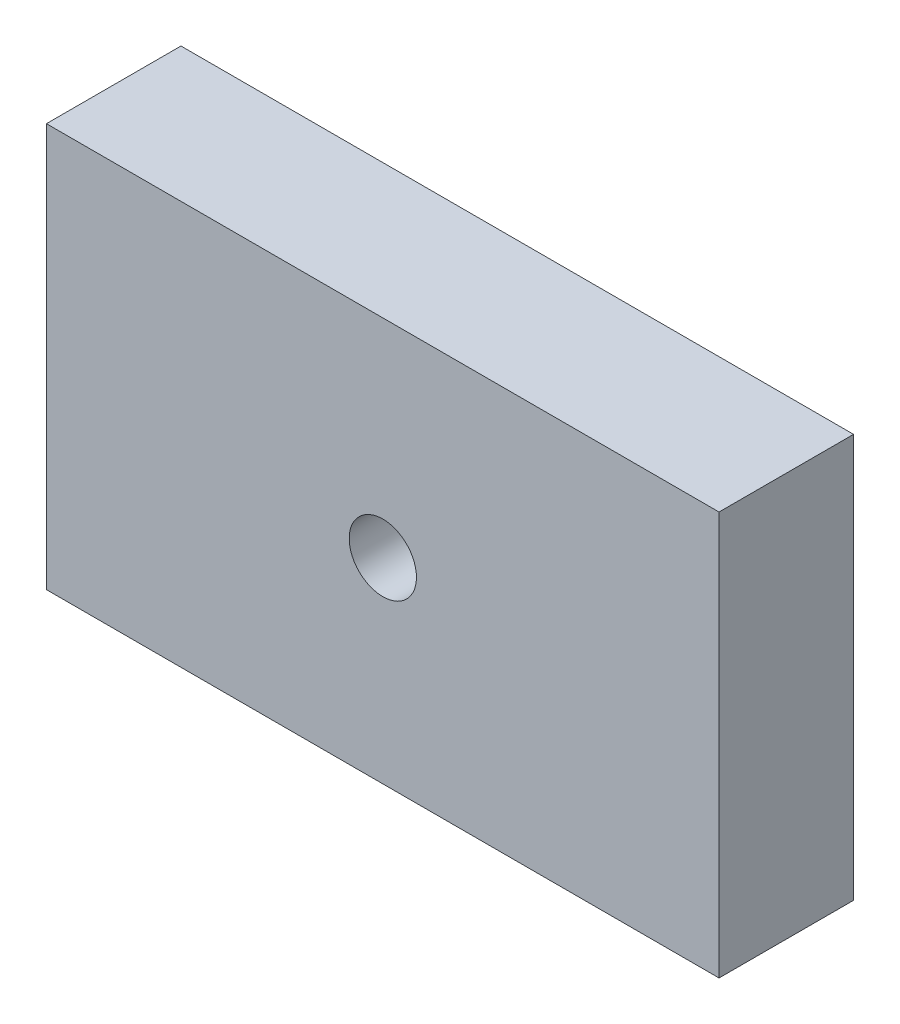
ISO-10303-21;
HEADER;
FILE_DESCRIPTION(('STEP AP214'),'2;1');
FILE_NAME('part.step','',(''),(''),'','','');
FILE_SCHEMA(('AUTOMOTIVE_DESIGN { 1 0 10303 214 1 1 1 1 }'));
ENDSEC;
DATA;
#1=APPLICATION_CONTEXT('core data for automotive mechanical design processes');
#2=APPLICATION_PROTOCOL_DEFINITION('international standard','automotive_design',2000,#1);
#3=PRODUCT_CONTEXT('',#1,'mechanical');
#4=PRODUCT('Part','Part','',(#3));
#5=PRODUCT_RELATED_PRODUCT_CATEGORY('part','',(#4));
#6=PRODUCT_DEFINITION_FORMATION('','',#4);
#7=PRODUCT_DEFINITION_CONTEXT('part definition',#1,'design');
#8=PRODUCT_DEFINITION('design','',#6,#7);
#9=PRODUCT_DEFINITION_SHAPE('','',#8);
#10=(LENGTH_UNIT() NAMED_UNIT(*) SI_UNIT(.MILLI.,.METRE.));
#11=(NAMED_UNIT(*) PLANE_ANGLE_UNIT() SI_UNIT($,.RADIAN.));
#12=(NAMED_UNIT(*) SI_UNIT($,.STERADIAN.) SOLID_ANGLE_UNIT());
#13=UNCERTAINTY_MEASURE_WITH_UNIT(LENGTH_MEASURE(1.E-05),#10,'distance_accuracy_value','');
#14=(GEOMETRIC_REPRESENTATION_CONTEXT(3) GLOBAL_UNCERTAINTY_ASSIGNED_CONTEXT((#13)) GLOBAL_UNIT_ASSIGNED_CONTEXT((#10,
#11,#12)) REPRESENTATION_CONTEXT('',''));
#15=CARTESIAN_POINT('',(0.,0.,0.));
#16=DIRECTION('',(0.,0.,1.));
#17=DIRECTION('',(1.,0.,0.));
#18=AXIS2_PLACEMENT_3D('',#15,#16,#17);
#19=CARTESIAN_POINT('',(-2.03858918141175,0.,10.));
#20=DIRECTION('',(1.,0.,0.));
#21=DIRECTION('',(0.,0.,-1.));
#22=AXIS2_PLACEMENT_3D('',#19,#20,#21);
#23=PLANE('',#22);
#24=DIRECTION('',(0.,-1.,0.));
#25=VECTOR('',#24,1.);
#26=CARTESIAN_POINT('',(-2.03858918141175,0.,0.));
#27=LINE('',#26,#25);
#28=CARTESIAN_POINT('',(-2.03858918141175,0.,0.));
#29=VERTEX_POINT('',#28);
#30=CARTESIAN_POINT('',(-2.03858918141175,-30.,0.));
#31=VERTEX_POINT('',#30);
#32=EDGE_CURVE('E107',#29,#31,#27,.T.);
#33=ORIENTED_EDGE('',*,*,#32,.T.);
#34=DIRECTION('',(0.,0.,-1.));
#35=VECTOR('',#34,1.);
#36=CARTESIAN_POINT('',(-2.03858918141175,-30.,10.));
#37=LINE('',#36,#35);
#38=CARTESIAN_POINT('',(-2.03858918141175,-30.,10.));
#39=VERTEX_POINT('',#38);
#40=EDGE_CURVE('E11',#39,#31,#37,.T.);
#41=ORIENTED_EDGE('',*,*,#40,.F.);
#42=DIRECTION('',(0.,-1.,0.));
#43=VECTOR('',#42,1.);
#44=CARTESIAN_POINT('',(-2.03858918141175,0.,10.));
#45=LINE('',#44,#43);
#46=CARTESIAN_POINT('',(-2.03858918141175,0.,10.));
#47=VERTEX_POINT('',#46);
#48=EDGE_CURVE('E91',#47,#39,#45,.T.);
#49=ORIENTED_EDGE('',*,*,#48,.F.);
#50=DIRECTION('',(0.,0.,-1.));
#51=VECTOR('',#50,1.);
#52=CARTESIAN_POINT('',(-2.03858918141175,0.,10.));
#53=LINE('',#52,#51);
#54=EDGE_CURVE('E103',#47,#29,#53,.T.);
#55=ORIENTED_EDGE('',*,*,#54,.T.);
#56=EDGE_LOOP('',(#33,#41,#49,#55));
#57=FACE_BOUND('',#56,.T.);
#58=ADVANCED_FACE('F39',(#57),#23,.F.);
#59=CARTESIAN_POINT('',(-2.03858918141175,-30.,10.));
#60=DIRECTION('',(0.,1.,0.));
#61=DIRECTION('',(-1.,0.,0.));
#62=AXIS2_PLACEMENT_3D('',#59,#60,#61);
#63=PLANE('',#62);
#64=DIRECTION('',(1.,0.,0.));
#65=VECTOR('',#64,1.);
#66=CARTESIAN_POINT('',(-2.03858918141175,-30.,0.));
#67=LINE('',#66,#65);
#68=CARTESIAN_POINT('',(47.9614108185882,-30.,0.));
#69=VERTEX_POINT('',#68);
#70=EDGE_CURVE('E96',#31,#69,#67,.T.);
#71=ORIENTED_EDGE('',*,*,#70,.T.);
#72=DIRECTION('',(0.,0.,-1.));
#73=VECTOR('',#72,1.);
#74=CARTESIAN_POINT('',(47.9614108185882,-30.,10.));
#75=LINE('',#74,#73);
#76=CARTESIAN_POINT('',(47.9614108185882,-30.,10.));
#77=VERTEX_POINT('',#76);
#78=EDGE_CURVE('E48',#77,#69,#75,.T.);
#79=ORIENTED_EDGE('',*,*,#78,.F.);
#80=DIRECTION('',(1.,0.,0.));
#81=VECTOR('',#80,1.);
#82=CARTESIAN_POINT('',(-2.03858918141175,-30.,10.));
#83=LINE('',#82,#81);
#84=EDGE_CURVE('E86',#39,#77,#83,.T.);
#85=ORIENTED_EDGE('',*,*,#84,.F.);
#86=ORIENTED_EDGE('',*,*,#40,.T.);
#87=EDGE_LOOP('',(#71,#79,#85,#86));
#88=FACE_BOUND('',#87,.T.);
#89=ADVANCED_FACE('F95',(#88),#63,.F.);
#90=CARTESIAN_POINT('',(47.9614108185882,0.,10.));
#91=DIRECTION('',(-1.,0.,0.));
#92=DIRECTION('',(0.,0.,1.));
#93=AXIS2_PLACEMENT_3D('',#90,#91,#92);
#94=PLANE('',#93);
#95=DIRECTION('',(0.,1.,0.));
#96=VECTOR('',#95,1.);
#97=CARTESIAN_POINT('',(47.9614108185882,0.,0.));
#98=LINE('',#97,#96);
#99=CARTESIAN_POINT('',(47.9614108185882,0.,0.));
#100=VERTEX_POINT('',#99);
#101=EDGE_CURVE('E73',#69,#100,#98,.T.);
#102=ORIENTED_EDGE('',*,*,#101,.T.);
#103=DIRECTION('',(0.,0.,-1.));
#104=VECTOR('',#103,1.);
#105=CARTESIAN_POINT('',(47.9614108185882,0.,10.));
#106=LINE('',#105,#104);
#107=CARTESIAN_POINT('',(47.9614108185882,0.,10.));
#108=VERTEX_POINT('',#107);
#109=EDGE_CURVE('E98',#108,#100,#106,.T.);
#110=ORIENTED_EDGE('',*,*,#109,.F.);
#111=DIRECTION('',(0.,1.,0.));
#112=VECTOR('',#111,1.);
#113=CARTESIAN_POINT('',(47.9614108185882,0.,10.));
#114=LINE('',#113,#112);
#115=EDGE_CURVE('E89',#77,#108,#114,.T.);
#116=ORIENTED_EDGE('',*,*,#115,.F.);
#117=ORIENTED_EDGE('',*,*,#78,.T.);
#118=EDGE_LOOP('',(#102,#110,#116,#117));
#119=FACE_BOUND('',#118,.T.);
#120=ADVANCED_FACE('F99',(#119),#94,.F.);
#121=CARTESIAN_POINT('',(-2.03858918141175,0.,10.));
#122=DIRECTION('',(0.,-1.,0.));
#123=DIRECTION('',(0.,0.,-1.));
#124=AXIS2_PLACEMENT_3D('',#121,#122,#123);
#125=PLANE('',#124);
#126=DIRECTION('',(-1.,0.,0.));
#127=VECTOR('',#126,1.);
#128=CARTESIAN_POINT('',(-2.03858918141175,0.,0.));
#129=LINE('',#128,#127);
#130=EDGE_CURVE('E79',#100,#29,#129,.T.);
#131=ORIENTED_EDGE('',*,*,#130,.T.);
#132=ORIENTED_EDGE('',*,*,#54,.F.);
#133=DIRECTION('',(-1.,0.,0.));
#134=VECTOR('',#133,1.);
#135=CARTESIAN_POINT('',(-2.03858918141175,0.,10.));
#136=LINE('',#135,#134);
#137=EDGE_CURVE('E56',#108,#47,#136,.T.);
#138=ORIENTED_EDGE('',*,*,#137,.F.);
#139=ORIENTED_EDGE('',*,*,#109,.T.);
#140=EDGE_LOOP('',(#131,#132,#138,#139));
#141=FACE_BOUND('',#140,.T.);
#142=ADVANCED_FACE('F121',(#141),#125,.F.);
#143=CARTESIAN_POINT('',(0.,0.,10.));
#144=DIRECTION('',(0.,0.,1.));
#145=DIRECTION('',(1.,0.,0.));
#146=AXIS2_PLACEMENT_3D('',#143,#144,#145);
#147=PLANE('',#146);
#148=CARTESIAN_POINT('',(22.968105579551,-15.4480513930473,10.));
#149=DIRECTION('',(0.,0.,1.));
#150=DIRECTION('',(1.,0.,0.));
#151=AXIS2_PLACEMENT_3D('',#148,#149,#150);
#152=CIRCLE('',#151,2.5);
#153=CARTESIAN_POINT('',(25.468105579551,-15.4480513930473,10.));
#154=VERTEX_POINT('',#153);
#155=EDGE_CURVE('E128',#154,#154,#152,.T.);
#156=ORIENTED_EDGE('',*,*,#155,.F.);
#157=EDGE_LOOP('',(#156));
#158=FACE_BOUND('',#157,.T.);
#159=ORIENTED_EDGE('',*,*,#48,.T.);
#160=ORIENTED_EDGE('',*,*,#84,.T.);
#161=ORIENTED_EDGE('',*,*,#115,.T.);
#162=ORIENTED_EDGE('',*,*,#137,.T.);
#163=EDGE_LOOP('',(#159,#160,#161,#162));
#164=FACE_BOUND('',#163,.T.);
#165=ADVANCED_FACE('F87',(#158,#164),#147,.T.);
#166=CARTESIAN_POINT('',(0.,0.,0.));
#167=DIRECTION('',(0.,0.,1.));
#168=DIRECTION('',(1.,0.,0.));
#169=AXIS2_PLACEMENT_3D('',#166,#167,#168);
#170=PLANE('',#169);
#171=CARTESIAN_POINT('',(22.968105579551,-15.4480513930473,0.));
#172=DIRECTION('',(0.,0.,1.));
#173=DIRECTION('',(1.,0.,0.));
#174=AXIS2_PLACEMENT_3D('',#171,#172,#173);
#175=CIRCLE('',#174,2.5);
#176=CARTESIAN_POINT('',(25.468105579551,-15.4480513930473,0.));
#177=VERTEX_POINT('',#176);
#178=EDGE_CURVE('E111',#177,#177,#175,.T.);
#179=ORIENTED_EDGE('',*,*,#178,.T.);
#180=EDGE_LOOP('',(#179));
#181=FACE_BOUND('',#180,.T.);
#182=ORIENTED_EDGE('',*,*,#32,.F.);
#183=ORIENTED_EDGE('',*,*,#130,.F.);
#184=ORIENTED_EDGE('',*,*,#101,.F.);
#185=ORIENTED_EDGE('',*,*,#70,.F.);
#186=EDGE_LOOP('',(#182,#183,#184,#185));
#187=FACE_BOUND('',#186,.T.);
#188=ADVANCED_FACE('F124',(#181,#187),#170,.F.);
#189=CARTESIAN_POINT('',(22.968105579551,-15.4480513930473,0.));
#190=DIRECTION('',(0.,0.,1.));
#191=DIRECTION('',(1.,0.,0.));
#192=AXIS2_PLACEMENT_3D('',#189,#190,#191);
#193=CYLINDRICAL_SURFACE('',#192,2.5);
#194=ORIENTED_EDGE('',*,*,#178,.F.);
#195=EDGE_LOOP('',(#194));
#196=FACE_BOUND('',#195,.T.);
#197=ORIENTED_EDGE('',*,*,#155,.T.);
#198=EDGE_LOOP('',(#197));
#199=FACE_BOUND('',#198,.T.);
#200=ADVANCED_FACE('F137',(#196,#199),#193,.F.);
#201=CLOSED_SHELL('',(#58,#89,#120,#142,#165,#188,#200));
#202=MANIFOLD_SOLID_BREP('B2',#201);
#203=ADVANCED_BREP_SHAPE_REPRESENTATION('',(#18,#202),#14);
#204=SHAPE_DEFINITION_REPRESENTATION(#9,#203);
ENDSEC;
END-ISO-10303-21;
